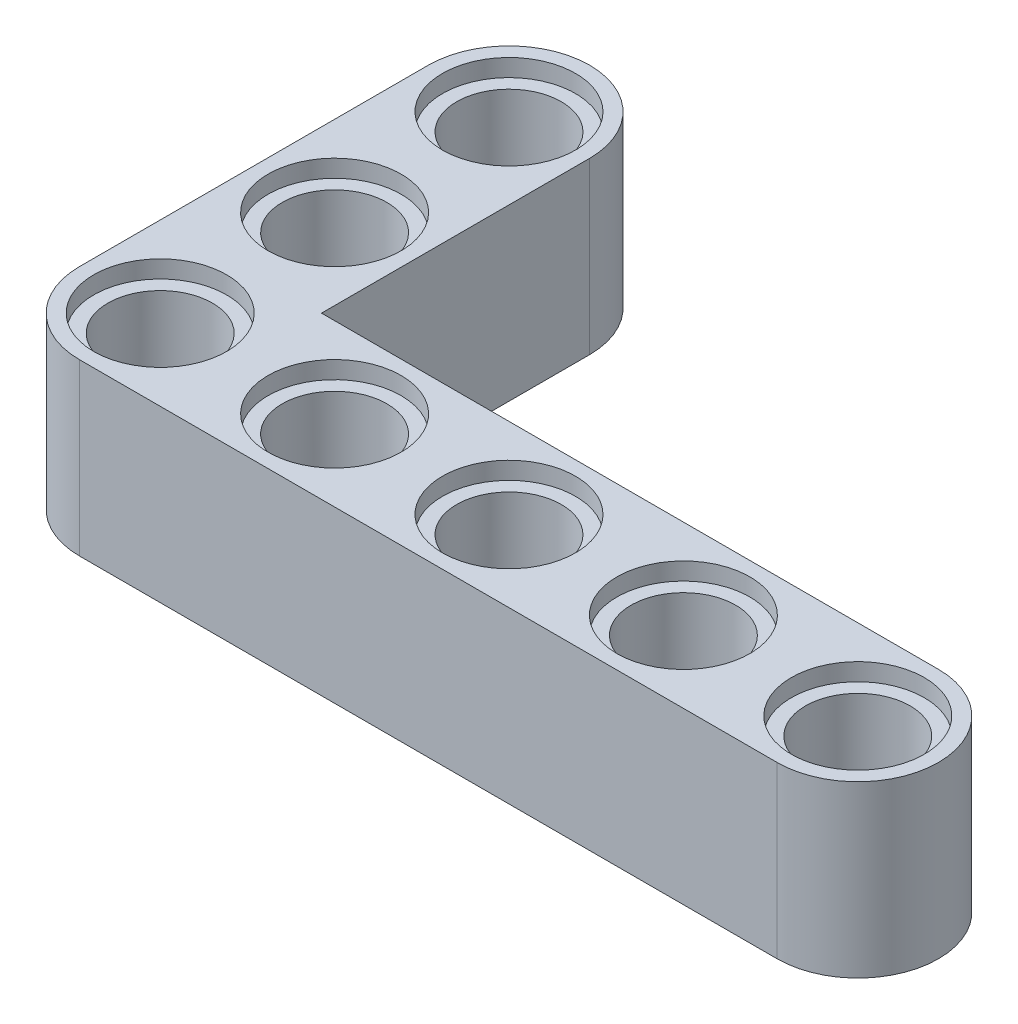
ISO-10303-21;
HEADER;
FILE_DESCRIPTION(('STEP AP214'),'2;1');
FILE_NAME('part.step','',(''),(''),'','','');
FILE_SCHEMA(('AUTOMOTIVE_DESIGN { 1 0 10303 214 1 1 1 1 }'));
ENDSEC;
DATA;
#1=APPLICATION_CONTEXT('core data for automotive mechanical design processes');
#2=APPLICATION_PROTOCOL_DEFINITION('international standard','automotive_design',2000,#1);
#3=PRODUCT_CONTEXT('',#1,'mechanical');
#4=PRODUCT('Part','Part','',(#3));
#5=PRODUCT_RELATED_PRODUCT_CATEGORY('part','',(#4));
#6=PRODUCT_DEFINITION_FORMATION('','',#4);
#7=PRODUCT_DEFINITION_CONTEXT('part definition',#1,'design');
#8=PRODUCT_DEFINITION('design','',#6,#7);
#9=PRODUCT_DEFINITION_SHAPE('','',#8);
#10=(LENGTH_UNIT() NAMED_UNIT(*) SI_UNIT(.MILLI.,.METRE.));
#11=(NAMED_UNIT(*) PLANE_ANGLE_UNIT() SI_UNIT($,.RADIAN.));
#12=(NAMED_UNIT(*) SI_UNIT($,.STERADIAN.) SOLID_ANGLE_UNIT());
#13=UNCERTAINTY_MEASURE_WITH_UNIT(LENGTH_MEASURE(1.E-05),#10,'distance_accuracy_value','');
#14=(GEOMETRIC_REPRESENTATION_CONTEXT(3) GLOBAL_UNCERTAINTY_ASSIGNED_CONTEXT((#13)) GLOBAL_UNIT_ASSIGNED_CONTEXT((#10,
#11,#12)) REPRESENTATION_CONTEXT('',''));
#15=CARTESIAN_POINT('',(0.,0.,0.));
#16=DIRECTION('',(0.,0.,1.));
#17=DIRECTION('',(1.,0.,0.));
#18=AXIS2_PLACEMENT_3D('',#15,#16,#17);
#19=CARTESIAN_POINT('',(0.,0.,0.));
#20=DIRECTION('',(0.,1.,0.));
#21=DIRECTION('',(0.,0.,1.));
#22=AXIS2_PLACEMENT_3D('',#19,#20,#21);
#23=CYLINDRICAL_SURFACE('',#22,2.4);
#24=CARTESIAN_POINT('',(0.,7.,0.));
#25=DIRECTION('',(0.,1.,0.));
#26=DIRECTION('',(0.,0.,1.));
#27=AXIS2_PLACEMENT_3D('',#24,#25,#26);
#28=CIRCLE('',#27,2.4);
#29=CARTESIAN_POINT('',(0.,7.,2.4));
#30=VERTEX_POINT('',#29);
#31=EDGE_CURVE('E134',#30,#30,#28,.F.);
#32=ORIENTED_EDGE('',*,*,#31,.F.);
#33=EDGE_LOOP('',(#32));
#34=FACE_BOUND('',#33,.T.);
#35=CARTESIAN_POINT('',(0.,0.8,0.));
#36=DIRECTION('',(0.,-1.,0.));
#37=DIRECTION('',(0.,0.,-1.));
#38=AXIS2_PLACEMENT_3D('',#35,#36,#37);
#39=CIRCLE('',#38,2.4);
#40=CARTESIAN_POINT('',(0.,0.8,-2.4));
#41=VERTEX_POINT('',#40);
#42=EDGE_CURVE('E40',#41,#41,#39,.F.);
#43=ORIENTED_EDGE('',*,*,#42,.F.);
#44=EDGE_LOOP('',(#43));
#45=FACE_BOUND('',#44,.T.);
#46=ADVANCED_FACE('F36',(#34,#45),#23,.F.);
#47=CARTESIAN_POINT('',(-16.,0.,-8.));
#48=DIRECTION('',(0.,1.,0.));
#49=DIRECTION('',(0.,0.,1.));
#50=AXIS2_PLACEMENT_3D('',#47,#48,#49);
#51=CYLINDRICAL_SURFACE('',#50,2.4);
#52=CARTESIAN_POINT('',(-16.,7.,-8.));
#53=DIRECTION('',(0.,1.,0.));
#54=DIRECTION('',(0.,0.,1.));
#55=AXIS2_PLACEMENT_3D('',#52,#53,#54);
#56=CIRCLE('',#55,2.4);
#57=CARTESIAN_POINT('',(-16.,7.,-5.6));
#58=VERTEX_POINT('',#57);
#59=EDGE_CURVE('E166',#58,#58,#56,.F.);
#60=ORIENTED_EDGE('',*,*,#59,.F.);
#61=EDGE_LOOP('',(#60));
#62=FACE_BOUND('',#61,.T.);
#63=CARTESIAN_POINT('',(-16.,0.8,-8.));
#64=DIRECTION('',(0.,-1.,0.));
#65=DIRECTION('',(0.,0.,-1.));
#66=AXIS2_PLACEMENT_3D('',#63,#64,#65);
#67=CIRCLE('',#66,2.4);
#68=CARTESIAN_POINT('',(-16.,0.8,-10.4));
#69=VERTEX_POINT('',#68);
#70=EDGE_CURVE('E189',#69,#69,#67,.F.);
#71=ORIENTED_EDGE('',*,*,#70,.F.);
#72=EDGE_LOOP('',(#71));
#73=FACE_BOUND('',#72,.T.);
#74=ADVANCED_FACE('F240',(#62,#73),#51,.F.);
#75=CARTESIAN_POINT('',(-16.,0.,-16.));
#76=DIRECTION('',(0.,1.,0.));
#77=DIRECTION('',(0.,0.,1.));
#78=AXIS2_PLACEMENT_3D('',#75,#76,#77);
#79=CYLINDRICAL_SURFACE('',#78,2.4);
#80=CARTESIAN_POINT('',(-16.,7.,-16.));
#81=DIRECTION('',(0.,1.,0.));
#82=DIRECTION('',(0.,0.,1.));
#83=AXIS2_PLACEMENT_3D('',#80,#81,#82);
#84=CIRCLE('',#83,2.4);
#85=CARTESIAN_POINT('',(-16.,7.,-13.6));
#86=VERTEX_POINT('',#85);
#87=EDGE_CURVE('E163',#86,#86,#84,.F.);
#88=ORIENTED_EDGE('',*,*,#87,.F.);
#89=EDGE_LOOP('',(#88));
#90=FACE_BOUND('',#89,.T.);
#91=CARTESIAN_POINT('',(-16.,0.8,-16.));
#92=DIRECTION('',(0.,-1.,0.));
#93=DIRECTION('',(0.,0.,-1.));
#94=AXIS2_PLACEMENT_3D('',#91,#92,#93);
#95=CIRCLE('',#94,2.4);
#96=CARTESIAN_POINT('',(-16.,0.8,-18.4));
#97=VERTEX_POINT('',#96);
#98=EDGE_CURVE('E187',#97,#97,#95,.F.);
#99=ORIENTED_EDGE('',*,*,#98,.F.);
#100=EDGE_LOOP('',(#99));
#101=FACE_BOUND('',#100,.T.);
#102=ADVANCED_FACE('F246',(#90,#101),#79,.F.);
#103=CARTESIAN_POINT('',(8.,0.,0.));
#104=DIRECTION('',(0.,1.,0.));
#105=DIRECTION('',(0.,0.,1.));
#106=AXIS2_PLACEMENT_3D('',#103,#104,#105);
#107=CYLINDRICAL_SURFACE('',#106,2.4);
#108=CARTESIAN_POINT('',(8.,7.,0.));
#109=DIRECTION('',(0.,1.,0.));
#110=DIRECTION('',(0.,0.,1.));
#111=AXIS2_PLACEMENT_3D('',#108,#109,#110);
#112=CIRCLE('',#111,2.4);
#113=CARTESIAN_POINT('',(8.,7.,2.4));
#114=VERTEX_POINT('',#113);
#115=EDGE_CURVE('E160',#114,#114,#112,.F.);
#116=ORIENTED_EDGE('',*,*,#115,.F.);
#117=EDGE_LOOP('',(#116));
#118=FACE_BOUND('',#117,.T.);
#119=CARTESIAN_POINT('',(8.,0.8,0.));
#120=DIRECTION('',(0.,-1.,0.));
#121=DIRECTION('',(0.,0.,-1.));
#122=AXIS2_PLACEMENT_3D('',#119,#120,#121);
#123=CIRCLE('',#122,2.4);
#124=CARTESIAN_POINT('',(8.,0.8,-2.4));
#125=VERTEX_POINT('',#124);
#126=EDGE_CURVE('E184',#125,#125,#123,.F.);
#127=ORIENTED_EDGE('',*,*,#126,.F.);
#128=EDGE_LOOP('',(#127));
#129=FACE_BOUND('',#128,.T.);
#130=ADVANCED_FACE('F252',(#118,#129),#107,.F.);
#131=CARTESIAN_POINT('',(-16.,0.,0.));
#132=DIRECTION('',(0.,1.,0.));
#133=DIRECTION('',(0.,0.,1.));
#134=AXIS2_PLACEMENT_3D('',#131,#132,#133);
#135=CYLINDRICAL_SURFACE('',#134,2.4);
#136=CARTESIAN_POINT('',(-16.,7.,0.));
#137=DIRECTION('',(0.,1.,0.));
#138=DIRECTION('',(0.,0.,1.));
#139=AXIS2_PLACEMENT_3D('',#136,#137,#138);
#140=CIRCLE('',#139,2.4);
#141=CARTESIAN_POINT('',(-16.,7.,2.4));
#142=VERTEX_POINT('',#141);
#143=EDGE_CURVE('E153',#142,#142,#140,.F.);
#144=ORIENTED_EDGE('',*,*,#143,.F.);
#145=EDGE_LOOP('',(#144));
#146=FACE_BOUND('',#145,.T.);
#147=CARTESIAN_POINT('',(-16.,0.8,0.));
#148=DIRECTION('',(0.,-1.,0.));
#149=DIRECTION('',(0.,0.,-1.));
#150=AXIS2_PLACEMENT_3D('',#147,#148,#149);
#151=CIRCLE('',#150,2.4);
#152=CARTESIAN_POINT('',(-16.,0.8,-2.4));
#153=VERTEX_POINT('',#152);
#154=EDGE_CURVE('E181',#153,#153,#151,.F.);
#155=ORIENTED_EDGE('',*,*,#154,.F.);
#156=EDGE_LOOP('',(#155));
#157=FACE_BOUND('',#156,.T.);
#158=ADVANCED_FACE('F363',(#146,#157),#135,.F.);
#159=CARTESIAN_POINT('',(-19.7,7.8,-16.));
#160=DIRECTION('',(1.,0.,0.));
#161=DIRECTION('',(0.,0.,-1.));
#162=AXIS2_PLACEMENT_3D('',#159,#160,#161);
#163=PLANE('',#162);
#164=DIRECTION('',(0.,0.,1.));
#165=VECTOR('',#164,1.);
#166=CARTESIAN_POINT('',(-19.7,0.,-16.));
#167=LINE('',#166,#165);
#168=CARTESIAN_POINT('',(-19.7,0.,-16.));
#169=VERTEX_POINT('',#168);
#170=CARTESIAN_POINT('',(-19.7,0.,0.));
#171=VERTEX_POINT('',#170);
#172=EDGE_CURVE('E130',#169,#171,#167,.T.);
#173=ORIENTED_EDGE('',*,*,#172,.T.);
#174=DIRECTION('',(0.,-1.,0.));
#175=VECTOR('',#174,1.);
#176=CARTESIAN_POINT('',(-19.7,7.8,0.));
#177=LINE('',#176,#175);
#178=CARTESIAN_POINT('',(-19.7,7.8,0.));
#179=VERTEX_POINT('',#178);
#180=EDGE_CURVE('E11',#179,#171,#177,.T.);
#181=ORIENTED_EDGE('',*,*,#180,.F.);
#182=DIRECTION('',(0.,0.,1.));
#183=VECTOR('',#182,1.);
#184=CARTESIAN_POINT('',(-19.7,7.8,-16.));
#185=LINE('',#184,#183);
#186=CARTESIAN_POINT('',(-19.7,7.8,-16.));
#187=VERTEX_POINT('',#186);
#188=EDGE_CURVE('E145',#187,#179,#185,.T.);
#189=ORIENTED_EDGE('',*,*,#188,.F.);
#190=DIRECTION('',(0.,-1.,0.));
#191=VECTOR('',#190,1.);
#192=CARTESIAN_POINT('',(-19.7,7.8,-16.));
#193=LINE('',#192,#191);
#194=EDGE_CURVE('E129',#187,#169,#193,.T.);
#195=ORIENTED_EDGE('',*,*,#194,.T.);
#196=EDGE_LOOP('',(#173,#181,#189,#195));
#197=FACE_BOUND('',#196,.T.);
#198=ADVANCED_FACE('F38',(#197),#163,.F.);
#199=CARTESIAN_POINT('',(-16.,7.8,0.));
#200=DIRECTION('',(0.,-1.,0.));
#201=DIRECTION('',(0.,0.,-1.));
#202=AXIS2_PLACEMENT_3D('',#199,#200,#201);
#203=CYLINDRICAL_SURFACE('',#202,3.7);
#204=CARTESIAN_POINT('',(-16.,0.,0.));
#205=DIRECTION('',(0.,1.,0.));
#206=DIRECTION('',(0.,0.,1.));
#207=AXIS2_PLACEMENT_3D('',#204,#205,#206);
#208=CIRCLE('',#207,3.7);
#209=CARTESIAN_POINT('',(-16.,0.,3.7));
#210=VERTEX_POINT('',#209);
#211=EDGE_CURVE('E133',#171,#210,#208,.T.);
#212=ORIENTED_EDGE('',*,*,#211,.T.);
#213=DIRECTION('',(0.,-1.,0.));
#214=VECTOR('',#213,1.);
#215=CARTESIAN_POINT('',(-16.,7.8,3.7));
#216=LINE('',#215,#214);
#217=CARTESIAN_POINT('',(-16.,7.8,3.7));
#218=VERTEX_POINT('',#217);
#219=EDGE_CURVE('E46',#218,#210,#216,.T.);
#220=ORIENTED_EDGE('',*,*,#219,.F.);
#221=CARTESIAN_POINT('',(-16.,7.8,0.));
#222=DIRECTION('',(0.,1.,0.));
#223=DIRECTION('',(0.,0.,1.));
#224=AXIS2_PLACEMENT_3D('',#221,#222,#223);
#225=CIRCLE('',#224,3.7);
#226=EDGE_CURVE('E94',#179,#218,#225,.T.);
#227=ORIENTED_EDGE('',*,*,#226,.F.);
#228=ORIENTED_EDGE('',*,*,#180,.T.);
#229=EDGE_LOOP('',(#212,#220,#227,#228));
#230=FACE_BOUND('',#229,.T.);
#231=ADVANCED_FACE('F706',(#230),#203,.T.);
#232=CARTESIAN_POINT('',(-16.,7.8,3.7));
#233=DIRECTION('',(0.,0.,-1.));
#234=DIRECTION('',(-1.,0.,0.));
#235=AXIS2_PLACEMENT_3D('',#232,#233,#234);
#236=PLANE('',#235);
#237=DIRECTION('',(1.,0.,0.));
#238=VECTOR('',#237,1.);
#239=CARTESIAN_POINT('',(-16.,0.,3.7));
#240=LINE('',#239,#238);
#241=CARTESIAN_POINT('',(16.,0.,3.7));
#242=VERTEX_POINT('',#241);
#243=EDGE_CURVE('E136',#210,#242,#240,.T.);
#244=ORIENTED_EDGE('',*,*,#243,.T.);
#245=DIRECTION('',(0.,-1.,0.));
#246=VECTOR('',#245,1.);
#247=CARTESIAN_POINT('',(16.,7.8,3.7));
#248=LINE('',#247,#246);
#249=CARTESIAN_POINT('',(16.,7.8,3.7));
#250=VERTEX_POINT('',#249);
#251=EDGE_CURVE('E149',#250,#242,#248,.T.);
#252=ORIENTED_EDGE('',*,*,#251,.F.);
#253=DIRECTION('',(1.,0.,0.));
#254=VECTOR('',#253,1.);
#255=CARTESIAN_POINT('',(-16.,7.8,3.7));
#256=LINE('',#255,#254);
#257=EDGE_CURVE('E124',#218,#250,#256,.T.);
#258=ORIENTED_EDGE('',*,*,#257,.F.);
#259=ORIENTED_EDGE('',*,*,#219,.T.);
#260=EDGE_LOOP('',(#244,#252,#258,#259));
#261=FACE_BOUND('',#260,.T.);
#262=ADVANCED_FACE('F217',(#261),#236,.F.);
#263=CARTESIAN_POINT('',(16.,7.8,0.));
#264=DIRECTION('',(0.,-1.,0.));
#265=DIRECTION('',(0.,0.,-1.));
#266=AXIS2_PLACEMENT_3D('',#263,#264,#265);
#267=CYLINDRICAL_SURFACE('',#266,3.7);
#268=CARTESIAN_POINT('',(16.,0.,0.));
#269=DIRECTION('',(0.,-1.,0.));
#270=DIRECTION('',(0.,0.,-1.));
#271=AXIS2_PLACEMENT_3D('',#268,#269,#270);
#272=CIRCLE('',#271,3.7);
#273=CARTESIAN_POINT('',(16.,0.,-3.7));
#274=VERTEX_POINT('',#273);
#275=EDGE_CURVE('E139',#274,#242,#272,.T.);
#276=ORIENTED_EDGE('',*,*,#275,.F.);
#277=DIRECTION('',(0.,-1.,0.));
#278=VECTOR('',#277,1.);
#279=CARTESIAN_POINT('',(16.,7.8,-3.7));
#280=LINE('',#279,#278);
#281=CARTESIAN_POINT('',(16.,7.8,-3.7));
#282=VERTEX_POINT('',#281);
#283=EDGE_CURVE('E113',#282,#274,#280,.T.);
#284=ORIENTED_EDGE('',*,*,#283,.F.);
#285=CARTESIAN_POINT('',(16.,7.8,0.));
#286=DIRECTION('',(0.,-1.,0.));
#287=DIRECTION('',(0.,0.,-1.));
#288=AXIS2_PLACEMENT_3D('',#285,#286,#287);
#289=CIRCLE('',#288,3.7);
#290=EDGE_CURVE('E122',#282,#250,#289,.T.);
#291=ORIENTED_EDGE('',*,*,#290,.T.);
#292=ORIENTED_EDGE('',*,*,#251,.T.);
#293=EDGE_LOOP('',(#276,#284,#291,#292));
#294=FACE_BOUND('',#293,.T.);
#295=ADVANCED_FACE('F221',(#294),#267,.T.);
#296=CARTESIAN_POINT('',(-12.3,7.8,-3.7));
#297=DIRECTION('',(0.,0.,-1.));
#298=DIRECTION('',(-1.,0.,0.));
#299=AXIS2_PLACEMENT_3D('',#296,#297,#298);
#300=PLANE('',#299);
#301=DIRECTION('',(1.,0.,0.));
#302=VECTOR('',#301,1.);
#303=CARTESIAN_POINT('',(-12.3,0.,-3.7));
#304=LINE('',#303,#302);
#305=CARTESIAN_POINT('',(-12.3,0.,-3.7));
#306=VERTEX_POINT('',#305);
#307=EDGE_CURVE('E112',#306,#274,#304,.T.);
#308=ORIENTED_EDGE('',*,*,#307,.F.);
#309=DIRECTION('',(0.,-1.,0.));
#310=VECTOR('',#309,1.);
#311=CARTESIAN_POINT('',(-12.3,7.8,-3.7));
#312=LINE('',#311,#310);
#313=CARTESIAN_POINT('',(-12.3,7.8,-3.7));
#314=VERTEX_POINT('',#313);
#315=EDGE_CURVE('E106',#314,#306,#312,.T.);
#316=ORIENTED_EDGE('',*,*,#315,.F.);
#317=DIRECTION('',(1.,0.,0.));
#318=VECTOR('',#317,1.);
#319=CARTESIAN_POINT('',(-12.3,7.8,-3.7));
#320=LINE('',#319,#318);
#321=EDGE_CURVE('E110',#314,#282,#320,.T.);
#322=ORIENTED_EDGE('',*,*,#321,.T.);
#323=ORIENTED_EDGE('',*,*,#283,.T.);
#324=EDGE_LOOP('',(#308,#316,#322,#323));
#325=FACE_BOUND('',#324,.T.);
#326=ADVANCED_FACE('F108',(#325),#300,.T.);
#327=CARTESIAN_POINT('',(-12.3,7.8,-3.7));
#328=DIRECTION('',(-1.,0.,0.));
#329=DIRECTION('',(0.,0.,1.));
#330=AXIS2_PLACEMENT_3D('',#327,#328,#329);
#331=PLANE('',#330);
#332=DIRECTION('',(0.,0.,-1.));
#333=VECTOR('',#332,1.);
#334=CARTESIAN_POINT('',(-12.3,0.,-3.7));
#335=LINE('',#334,#333);
#336=CARTESIAN_POINT('',(-12.3,0.,-16.));
#337=VERTEX_POINT('',#336);
#338=EDGE_CURVE('E80',#306,#337,#335,.T.);
#339=ORIENTED_EDGE('',*,*,#338,.T.);
#340=DIRECTION('',(0.,-1.,0.));
#341=VECTOR('',#340,1.);
#342=CARTESIAN_POINT('',(-12.3,7.8,-16.));
#343=LINE('',#342,#341);
#344=CARTESIAN_POINT('',(-12.3,7.8,-16.));
#345=VERTEX_POINT('',#344);
#346=EDGE_CURVE('E114',#345,#337,#343,.T.);
#347=ORIENTED_EDGE('',*,*,#346,.F.);
#348=DIRECTION('',(0.,0.,-1.));
#349=VECTOR('',#348,1.);
#350=CARTESIAN_POINT('',(-12.3,7.8,-3.7));
#351=LINE('',#350,#349);
#352=EDGE_CURVE('E116',#314,#345,#351,.T.);
#353=ORIENTED_EDGE('',*,*,#352,.F.);
#354=ORIENTED_EDGE('',*,*,#315,.T.);
#355=EDGE_LOOP('',(#339,#347,#353,#354));
#356=FACE_BOUND('',#355,.T.);
#357=ADVANCED_FACE('F117',(#356),#331,.F.);
#358=CARTESIAN_POINT('',(-16.,7.8,-16.));
#359=DIRECTION('',(0.,-1.,0.));
#360=DIRECTION('',(0.,0.,-1.));
#361=AXIS2_PLACEMENT_3D('',#358,#359,#360);
#362=CYLINDRICAL_SURFACE('',#361,3.7);
#363=CARTESIAN_POINT('',(-16.,0.,-16.));
#364=DIRECTION('',(0.,1.,0.));
#365=DIRECTION('',(0.,0.,1.));
#366=AXIS2_PLACEMENT_3D('',#363,#364,#365);
#367=CIRCLE('',#366,3.7);
#368=EDGE_CURVE('E86',#337,#169,#367,.T.);
#369=ORIENTED_EDGE('',*,*,#368,.T.);
#370=ORIENTED_EDGE('',*,*,#194,.F.);
#371=CARTESIAN_POINT('',(-16.,7.8,-16.));
#372=DIRECTION('',(0.,1.,0.));
#373=DIRECTION('',(0.,0.,1.));
#374=AXIS2_PLACEMENT_3D('',#371,#372,#373);
#375=CIRCLE('',#374,3.7);
#376=EDGE_CURVE('E55',#345,#187,#375,.T.);
#377=ORIENTED_EDGE('',*,*,#376,.F.);
#378=ORIENTED_EDGE('',*,*,#346,.T.);
#379=EDGE_LOOP('',(#369,#370,#377,#378));
#380=FACE_BOUND('',#379,.T.);
#381=ADVANCED_FACE('F228',(#380),#362,.T.);
#382=CARTESIAN_POINT('',(-16.,7.8,0.));
#383=DIRECTION('',(0.,1.,0.));
#384=DIRECTION('',(0.,0.,1.));
#385=AXIS2_PLACEMENT_3D('',#382,#383,#384);
#386=PLANE('',#385);
#387=CARTESIAN_POINT('',(-16.,7.8,-16.));
#388=DIRECTION('',(0.,1.,0.));
#389=DIRECTION('',(0.,0.,1.));
#390=AXIS2_PLACEMENT_3D('',#387,#388,#389);
#391=CIRCLE('',#390,3.05);
#392=CARTESIAN_POINT('',(-16.,7.8,-12.95));
#393=VERTEX_POINT('',#392);
#394=EDGE_CURVE('E194',#393,#393,#391,.T.);
#395=ORIENTED_EDGE('',*,*,#394,.F.);
#396=EDGE_LOOP('',(#395));
#397=FACE_BOUND('',#396,.T.);
#398=CARTESIAN_POINT('',(-16.,7.8,-8.));
#399=DIRECTION('',(0.,1.,0.));
#400=DIRECTION('',(0.,0.,1.));
#401=AXIS2_PLACEMENT_3D('',#398,#399,#400);
#402=CIRCLE('',#401,3.05);
#403=CARTESIAN_POINT('',(-16.,7.8,-4.95));
#404=VERTEX_POINT('',#403);
#405=EDGE_CURVE('E203',#404,#404,#402,.T.);
#406=ORIENTED_EDGE('',*,*,#405,.F.);
#407=EDGE_LOOP('',(#406));
#408=FACE_BOUND('',#407,.T.);
#409=CARTESIAN_POINT('',(-8.,7.8,0.));
#410=DIRECTION('',(0.,1.,0.));
#411=DIRECTION('',(0.,0.,-1.));
#412=AXIS2_PLACEMENT_3D('',#409,#410,#411);
#413=CIRCLE('',#412,3.05);
#414=CARTESIAN_POINT('',(-8.,7.8,-3.05));
#415=VERTEX_POINT('',#414);
#416=EDGE_CURVE('E319',#415,#415,#413,.T.);
#417=ORIENTED_EDGE('',*,*,#416,.F.);
#418=EDGE_LOOP('',(#417));
#419=FACE_BOUND('',#418,.T.);
#420=CARTESIAN_POINT('',(-16.,7.8,0.));
#421=DIRECTION('',(0.,1.,0.));
#422=DIRECTION('',(0.,0.,1.));
#423=AXIS2_PLACEMENT_3D('',#420,#421,#422);
#424=CIRCLE('',#423,3.05);
#425=CARTESIAN_POINT('',(-16.,7.8,3.05));
#426=VERTEX_POINT('',#425);
#427=EDGE_CURVE('E313',#426,#426,#424,.T.);
#428=ORIENTED_EDGE('',*,*,#427,.F.);
#429=EDGE_LOOP('',(#428));
#430=FACE_BOUND('',#429,.T.);
#431=CARTESIAN_POINT('',(16.,7.8,0.));
#432=DIRECTION('',(0.,1.,0.));
#433=DIRECTION('',(0.,0.,-1.));
#434=AXIS2_PLACEMENT_3D('',#431,#432,#433);
#435=CIRCLE('',#434,3.05);
#436=CARTESIAN_POINT('',(16.,7.8,-3.05));
#437=VERTEX_POINT('',#436);
#438=EDGE_CURVE('E307',#437,#437,#435,.T.);
#439=ORIENTED_EDGE('',*,*,#438,.F.);
#440=EDGE_LOOP('',(#439));
#441=FACE_BOUND('',#440,.T.);
#442=CARTESIAN_POINT('',(0.,7.8,0.));
#443=DIRECTION('',(0.,1.,0.));
#444=DIRECTION('',(0.,0.,1.));
#445=AXIS2_PLACEMENT_3D('',#442,#443,#444);
#446=CIRCLE('',#445,3.05);
#447=CARTESIAN_POINT('',(0.,7.8,3.05));
#448=VERTEX_POINT('',#447);
#449=EDGE_CURVE('E301',#448,#448,#446,.T.);
#450=ORIENTED_EDGE('',*,*,#449,.F.);
#451=EDGE_LOOP('',(#450));
#452=FACE_BOUND('',#451,.T.);
#453=CARTESIAN_POINT('',(8.,7.8,0.));
#454=DIRECTION('',(0.,1.,0.));
#455=DIRECTION('',(0.,0.,1.));
#456=AXIS2_PLACEMENT_3D('',#453,#454,#455);
#457=CIRCLE('',#456,3.05);
#458=CARTESIAN_POINT('',(8.,7.8,3.05));
#459=VERTEX_POINT('',#458);
#460=EDGE_CURVE('E209',#459,#459,#457,.T.);
#461=ORIENTED_EDGE('',*,*,#460,.F.);
#462=EDGE_LOOP('',(#461));
#463=FACE_BOUND('',#462,.T.);
#464=ORIENTED_EDGE('',*,*,#188,.T.);
#465=ORIENTED_EDGE('',*,*,#226,.T.);
#466=ORIENTED_EDGE('',*,*,#257,.T.);
#467=ORIENTED_EDGE('',*,*,#290,.F.);
#468=ORIENTED_EDGE('',*,*,#321,.F.);
#469=ORIENTED_EDGE('',*,*,#352,.T.);
#470=ORIENTED_EDGE('',*,*,#376,.T.);
#471=EDGE_LOOP('',(#464,#465,#466,#467,#468,#469,#470));
#472=FACE_BOUND('',#471,.T.);
#473=ADVANCED_FACE('F120',(#397,#408,#419,#430,#441,#452,#463,#472),#386,.T.);
#474=CARTESIAN_POINT('',(-16.,0.,0.));
#475=DIRECTION('',(0.,1.,0.));
#476=DIRECTION('',(0.,0.,1.));
#477=AXIS2_PLACEMENT_3D('',#474,#475,#476);
#478=PLANE('',#477);
#479=CARTESIAN_POINT('',(-16.,0.,-16.));
#480=DIRECTION('',(0.,-1.,0.));
#481=DIRECTION('',(0.,0.,-1.));
#482=AXIS2_PLACEMENT_3D('',#479,#480,#481);
#483=CIRCLE('',#482,3.05);
#484=CARTESIAN_POINT('',(-16.,0.,-19.05));
#485=VERTEX_POINT('',#484);
#486=EDGE_CURVE('E266',#485,#485,#483,.T.);
#487=ORIENTED_EDGE('',*,*,#486,.F.);
#488=EDGE_LOOP('',(#487));
#489=FACE_BOUND('',#488,.T.);
#490=CARTESIAN_POINT('',(-16.,0.,-8.));
#491=DIRECTION('',(0.,-1.,0.));
#492=DIRECTION('',(0.,0.,-1.));
#493=AXIS2_PLACEMENT_3D('',#490,#491,#492);
#494=CIRCLE('',#493,3.05);
#495=CARTESIAN_POINT('',(-16.,0.,-11.05));
#496=VERTEX_POINT('',#495);
#497=EDGE_CURVE('E270',#496,#496,#494,.T.);
#498=ORIENTED_EDGE('',*,*,#497,.F.);
#499=EDGE_LOOP('',(#498));
#500=FACE_BOUND('',#499,.T.);
#501=CARTESIAN_POINT('',(-8.,0.,0.));
#502=DIRECTION('',(0.,-1.,0.));
#503=DIRECTION('',(0.,0.,1.));
#504=AXIS2_PLACEMENT_3D('',#501,#502,#503);
#505=CIRCLE('',#504,3.05);
#506=CARTESIAN_POINT('',(-8.,0.,3.05));
#507=VERTEX_POINT('',#506);
#508=EDGE_CURVE('E274',#507,#507,#505,.T.);
#509=ORIENTED_EDGE('',*,*,#508,.F.);
#510=EDGE_LOOP('',(#509));
#511=FACE_BOUND('',#510,.T.);
#512=CARTESIAN_POINT('',(-16.,0.,0.));
#513=DIRECTION('',(0.,-1.,0.));
#514=DIRECTION('',(0.,0.,-1.));
#515=AXIS2_PLACEMENT_3D('',#512,#513,#514);
#516=CIRCLE('',#515,3.05);
#517=CARTESIAN_POINT('',(-16.,0.,-3.05));
#518=VERTEX_POINT('',#517);
#519=EDGE_CURVE('E278',#518,#518,#516,.T.);
#520=ORIENTED_EDGE('',*,*,#519,.F.);
#521=EDGE_LOOP('',(#520));
#522=FACE_BOUND('',#521,.T.);
#523=CARTESIAN_POINT('',(16.,0.,0.));
#524=DIRECTION('',(0.,-1.,0.));
#525=DIRECTION('',(0.,0.,1.));
#526=AXIS2_PLACEMENT_3D('',#523,#524,#525);
#527=CIRCLE('',#526,3.05);
#528=CARTESIAN_POINT('',(16.,0.,3.05));
#529=VERTEX_POINT('',#528);
#530=EDGE_CURVE('E282',#529,#529,#527,.T.);
#531=ORIENTED_EDGE('',*,*,#530,.F.);
#532=EDGE_LOOP('',(#531));
#533=FACE_BOUND('',#532,.T.);
#534=CARTESIAN_POINT('',(0.,0.,0.));
#535=DIRECTION('',(0.,-1.,0.));
#536=DIRECTION('',(0.,0.,-1.));
#537=AXIS2_PLACEMENT_3D('',#534,#535,#536);
#538=CIRCLE('',#537,3.05);
#539=CARTESIAN_POINT('',(0.,0.,-3.05));
#540=VERTEX_POINT('',#539);
#541=EDGE_CURVE('E286',#540,#540,#538,.T.);
#542=ORIENTED_EDGE('',*,*,#541,.F.);
#543=EDGE_LOOP('',(#542));
#544=FACE_BOUND('',#543,.T.);
#545=CARTESIAN_POINT('',(8.,0.,0.));
#546=DIRECTION('',(0.,-1.,0.));
#547=DIRECTION('',(0.,0.,-1.));
#548=AXIS2_PLACEMENT_3D('',#545,#546,#547);
#549=CIRCLE('',#548,3.05);
#550=CARTESIAN_POINT('',(8.,0.,-3.05));
#551=VERTEX_POINT('',#550);
#552=EDGE_CURVE('E289',#551,#551,#549,.T.);
#553=ORIENTED_EDGE('',*,*,#552,.F.);
#554=EDGE_LOOP('',(#553));
#555=FACE_BOUND('',#554,.T.);
#556=ORIENTED_EDGE('',*,*,#172,.F.);
#557=ORIENTED_EDGE('',*,*,#368,.F.);
#558=ORIENTED_EDGE('',*,*,#338,.F.);
#559=ORIENTED_EDGE('',*,*,#307,.T.);
#560=ORIENTED_EDGE('',*,*,#275,.T.);
#561=ORIENTED_EDGE('',*,*,#243,.F.);
#562=ORIENTED_EDGE('',*,*,#211,.F.);
#563=EDGE_LOOP('',(#556,#557,#558,#559,#560,#561,#562));
#564=FACE_BOUND('',#563,.T.);
#565=ADVANCED_FACE('F224',(#489,#500,#511,#522,#533,#544,#555,#564),#478,.F.);
#566=CARTESIAN_POINT('',(-8.,0.,0.));
#567=DIRECTION('',(0.,1.,0.));
#568=DIRECTION('',(0.,0.,1.));
#569=AXIS2_PLACEMENT_3D('',#566,#567,#568);
#570=CYLINDRICAL_SURFACE('',#569,2.4);
#571=CARTESIAN_POINT('',(-8.,0.8,0.));
#572=DIRECTION('',(0.,1.,0.));
#573=DIRECTION('',(0.,0.,1.));
#574=AXIS2_PLACEMENT_3D('',#571,#572,#573);
#575=CIRCLE('',#574,2.4);
#576=CARTESIAN_POINT('',(-8.,0.8,2.4));
#577=VERTEX_POINT('',#576);
#578=EDGE_CURVE('E177',#577,#577,#575,.F.);
#579=ORIENTED_EDGE('',*,*,#578,.T.);
#580=EDGE_LOOP('',(#579));
#581=FACE_BOUND('',#580,.T.);
#582=CARTESIAN_POINT('',(-8.,7.,0.));
#583=DIRECTION('',(0.,-1.,0.));
#584=DIRECTION('',(0.,0.,-1.));
#585=AXIS2_PLACEMENT_3D('',#582,#583,#584);
#586=CIRCLE('',#585,2.4);
#587=CARTESIAN_POINT('',(-8.,7.,-2.4));
#588=VERTEX_POINT('',#587);
#589=EDGE_CURVE('E169',#588,#588,#586,.F.);
#590=ORIENTED_EDGE('',*,*,#589,.T.);
#591=EDGE_LOOP('',(#590));
#592=FACE_BOUND('',#591,.T.);
#593=ADVANCED_FACE('F255',(#581,#592),#570,.F.);
#594=CARTESIAN_POINT('',(16.,0.,0.));
#595=DIRECTION('',(0.,1.,0.));
#596=DIRECTION('',(0.,0.,1.));
#597=AXIS2_PLACEMENT_3D('',#594,#595,#596);
#598=CYLINDRICAL_SURFACE('',#597,2.4);
#599=CARTESIAN_POINT('',(16.,0.8,0.));
#600=DIRECTION('',(0.,1.,0.));
#601=DIRECTION('',(0.,0.,1.));
#602=AXIS2_PLACEMENT_3D('',#599,#600,#601);
#603=CIRCLE('',#602,2.4);
#604=CARTESIAN_POINT('',(16.,0.8,2.4));
#605=VERTEX_POINT('',#604);
#606=EDGE_CURVE('E174',#605,#605,#603,.F.);
#607=ORIENTED_EDGE('',*,*,#606,.T.);
#608=EDGE_LOOP('',(#607));
#609=FACE_BOUND('',#608,.T.);
#610=CARTESIAN_POINT('',(16.,7.,0.));
#611=DIRECTION('',(0.,-1.,0.));
#612=DIRECTION('',(0.,0.,-1.));
#613=AXIS2_PLACEMENT_3D('',#610,#611,#612);
#614=CIRCLE('',#613,2.4);
#615=CARTESIAN_POINT('',(16.,7.,-2.4));
#616=VERTEX_POINT('',#615);
#617=EDGE_CURVE('E156',#616,#616,#614,.F.);
#618=ORIENTED_EDGE('',*,*,#617,.T.);
#619=EDGE_LOOP('',(#618));
#620=FACE_BOUND('',#619,.T.);
#621=ADVANCED_FACE('F260',(#609,#620),#598,.F.);
#622=CARTESIAN_POINT('',(-16.,7.,0.));
#623=DIRECTION('',(0.,1.,0.));
#624=DIRECTION('',(0.,0.,1.));
#625=AXIS2_PLACEMENT_3D('',#622,#623,#624);
#626=PLANE('',#625);
#627=CARTESIAN_POINT('',(-16.,7.,0.));
#628=DIRECTION('',(0.,1.,0.));
#629=DIRECTION('',(0.,0.,1.));
#630=AXIS2_PLACEMENT_3D('',#627,#628,#629);
#631=CIRCLE('',#630,3.05);
#632=CARTESIAN_POINT('',(-16.,7.,3.05));
#633=VERTEX_POINT('',#632);
#634=EDGE_CURVE('E310',#633,#633,#631,.T.);
#635=ORIENTED_EDGE('',*,*,#634,.T.);
#636=EDGE_LOOP('',(#635));
#637=FACE_BOUND('',#636,.T.);
#638=ORIENTED_EDGE('',*,*,#143,.T.);
#639=EDGE_LOOP('',(#638));
#640=FACE_BOUND('',#639,.T.);
#641=ADVANCED_FACE('F361',(#637,#640),#626,.T.);
#642=CARTESIAN_POINT('',(-16.,7.,0.));
#643=DIRECTION('',(0.,1.,0.));
#644=DIRECTION('',(0.,0.,1.));
#645=AXIS2_PLACEMENT_3D('',#642,#643,#644);
#646=CYLINDRICAL_SURFACE('',#645,3.05);
#647=ORIENTED_EDGE('',*,*,#634,.F.);
#648=EDGE_LOOP('',(#647));
#649=FACE_BOUND('',#648,.T.);
#650=ORIENTED_EDGE('',*,*,#427,.T.);
#651=EDGE_LOOP('',(#650));
#652=FACE_BOUND('',#651,.T.);
#653=ADVANCED_FACE('F417',(#649,#652),#646,.F.);
#654=CARTESIAN_POINT('',(16.,7.,0.));
#655=DIRECTION('',(0.,-1.,0.));
#656=DIRECTION('',(0.,0.,-1.));
#657=AXIS2_PLACEMENT_3D('',#654,#655,#656);
#658=PLANE('',#657);
#659=CARTESIAN_POINT('',(16.,7.,0.));
#660=DIRECTION('',(0.,1.,0.));
#661=DIRECTION('',(0.,0.,-1.));
#662=AXIS2_PLACEMENT_3D('',#659,#660,#661);
#663=CIRCLE('',#662,3.05);
#664=CARTESIAN_POINT('',(16.,7.,-3.05));
#665=VERTEX_POINT('',#664);
#666=EDGE_CURVE('E304',#665,#665,#663,.T.);
#667=ORIENTED_EDGE('',*,*,#666,.T.);
#668=EDGE_LOOP('',(#667));
#669=FACE_BOUND('',#668,.T.);
#670=ORIENTED_EDGE('',*,*,#617,.F.);
#671=EDGE_LOOP('',(#670));
#672=FACE_BOUND('',#671,.T.);
#673=ADVANCED_FACE('F414',(#669,#672),#658,.F.);
#674=CARTESIAN_POINT('',(16.,7.,0.));
#675=DIRECTION('',(0.,1.,0.));
#676=DIRECTION('',(0.,0.,1.));
#677=AXIS2_PLACEMENT_3D('',#674,#675,#676);
#678=CYLINDRICAL_SURFACE('',#677,3.05);
#679=ORIENTED_EDGE('',*,*,#666,.F.);
#680=EDGE_LOOP('',(#679));
#681=FACE_BOUND('',#680,.T.);
#682=ORIENTED_EDGE('',*,*,#438,.T.);
#683=EDGE_LOOP('',(#682));
#684=FACE_BOUND('',#683,.T.);
#685=ADVANCED_FACE('F353',(#681,#684),#678,.F.);
#686=CARTESIAN_POINT('',(8.,7.,0.));
#687=DIRECTION('',(0.,1.,0.));
#688=DIRECTION('',(0.,0.,1.));
#689=AXIS2_PLACEMENT_3D('',#686,#687,#688);
#690=PLANE('',#689);
#691=CARTESIAN_POINT('',(8.,7.,0.));
#692=DIRECTION('',(0.,1.,0.));
#693=DIRECTION('',(0.,0.,1.));
#694=AXIS2_PLACEMENT_3D('',#691,#692,#693);
#695=CIRCLE('',#694,3.05);
#696=CARTESIAN_POINT('',(8.,7.,3.05));
#697=VERTEX_POINT('',#696);
#698=EDGE_CURVE('E157',#697,#697,#695,.T.);
#699=ORIENTED_EDGE('',*,*,#698,.T.);
#700=EDGE_LOOP('',(#699));
#701=FACE_BOUND('',#700,.T.);
#702=ORIENTED_EDGE('',*,*,#115,.T.);
#703=EDGE_LOOP('',(#702));
#704=FACE_BOUND('',#703,.T.);
#705=ADVANCED_FACE('F343',(#701,#704),#690,.T.);
#706=CARTESIAN_POINT('',(8.,7.,0.));
#707=DIRECTION('',(0.,1.,0.));
#708=DIRECTION('',(0.,0.,1.));
#709=AXIS2_PLACEMENT_3D('',#706,#707,#708);
#710=CYLINDRICAL_SURFACE('',#709,3.05);
#711=ORIENTED_EDGE('',*,*,#698,.F.);
#712=EDGE_LOOP('',(#711));
#713=FACE_BOUND('',#712,.T.);
#714=ORIENTED_EDGE('',*,*,#460,.T.);
#715=EDGE_LOOP('',(#714));
#716=FACE_BOUND('',#715,.T.);
#717=ADVANCED_FACE('F340',(#713,#716),#710,.F.);
#718=CARTESIAN_POINT('',(-16.,7.,-16.));
#719=DIRECTION('',(0.,1.,0.));
#720=DIRECTION('',(0.,0.,1.));
#721=AXIS2_PLACEMENT_3D('',#718,#719,#720);
#722=PLANE('',#721);
#723=CARTESIAN_POINT('',(-16.,7.,-16.));
#724=DIRECTION('',(0.,1.,0.));
#725=DIRECTION('',(0.,0.,1.));
#726=AXIS2_PLACEMENT_3D('',#723,#724,#725);
#727=CIRCLE('',#726,3.05);
#728=CARTESIAN_POINT('',(-16.,7.,-12.95));
#729=VERTEX_POINT('',#728);
#730=EDGE_CURVE('E198',#729,#729,#727,.T.);
#731=ORIENTED_EDGE('',*,*,#730,.T.);
#732=EDGE_LOOP('',(#731));
#733=FACE_BOUND('',#732,.T.);
#734=ORIENTED_EDGE('',*,*,#87,.T.);
#735=EDGE_LOOP('',(#734));
#736=FACE_BOUND('',#735,.T.);
#737=ADVANCED_FACE('F342',(#733,#736),#722,.T.);
#738=CARTESIAN_POINT('',(-16.,7.,-16.));
#739=DIRECTION('',(0.,1.,0.));
#740=DIRECTION('',(0.,0.,1.));
#741=AXIS2_PLACEMENT_3D('',#738,#739,#740);
#742=CYLINDRICAL_SURFACE('',#741,3.05);
#743=ORIENTED_EDGE('',*,*,#730,.F.);
#744=EDGE_LOOP('',(#743));
#745=FACE_BOUND('',#744,.T.);
#746=ORIENTED_EDGE('',*,*,#394,.T.);
#747=EDGE_LOOP('',(#746));
#748=FACE_BOUND('',#747,.T.);
#749=ADVANCED_FACE('F350',(#745,#748),#742,.F.);
#750=CARTESIAN_POINT('',(-16.,7.,-8.));
#751=DIRECTION('',(0.,1.,0.));
#752=DIRECTION('',(0.,0.,1.));
#753=AXIS2_PLACEMENT_3D('',#750,#751,#752);
#754=PLANE('',#753);
#755=CARTESIAN_POINT('',(-16.,7.,-8.));
#756=DIRECTION('',(0.,1.,0.));
#757=DIRECTION('',(0.,0.,1.));
#758=AXIS2_PLACEMENT_3D('',#755,#756,#757);
#759=CIRCLE('',#758,3.05);
#760=CARTESIAN_POINT('',(-16.,7.,-4.95));
#761=VERTEX_POINT('',#760);
#762=EDGE_CURVE('E322',#761,#761,#759,.T.);
#763=ORIENTED_EDGE('',*,*,#762,.T.);
#764=EDGE_LOOP('',(#763));
#765=FACE_BOUND('',#764,.T.);
#766=ORIENTED_EDGE('',*,*,#59,.T.);
#767=EDGE_LOOP('',(#766));
#768=FACE_BOUND('',#767,.T.);
#769=ADVANCED_FACE('F435',(#765,#768),#754,.T.);
#770=CARTESIAN_POINT('',(-16.,7.,-8.));
#771=DIRECTION('',(0.,1.,0.));
#772=DIRECTION('',(0.,0.,1.));
#773=AXIS2_PLACEMENT_3D('',#770,#771,#772);
#774=CYLINDRICAL_SURFACE('',#773,3.05);
#775=ORIENTED_EDGE('',*,*,#762,.F.);
#776=EDGE_LOOP('',(#775));
#777=FACE_BOUND('',#776,.T.);
#778=ORIENTED_EDGE('',*,*,#405,.T.);
#779=EDGE_LOOP('',(#778));
#780=FACE_BOUND('',#779,.T.);
#781=ADVANCED_FACE('F327',(#777,#780),#774,.F.);
#782=CARTESIAN_POINT('',(-8.,7.,0.));
#783=DIRECTION('',(0.,-1.,0.));
#784=DIRECTION('',(0.,0.,-1.));
#785=AXIS2_PLACEMENT_3D('',#782,#783,#784);
#786=PLANE('',#785);
#787=CARTESIAN_POINT('',(-8.,7.,0.));
#788=DIRECTION('',(0.,1.,0.));
#789=DIRECTION('',(0.,0.,-1.));
#790=AXIS2_PLACEMENT_3D('',#787,#788,#789);
#791=CIRCLE('',#790,3.05);
#792=CARTESIAN_POINT('',(-8.,7.,-3.05));
#793=VERTEX_POINT('',#792);
#794=EDGE_CURVE('E316',#793,#793,#791,.T.);
#795=ORIENTED_EDGE('',*,*,#794,.T.);
#796=EDGE_LOOP('',(#795));
#797=FACE_BOUND('',#796,.T.);
#798=ORIENTED_EDGE('',*,*,#589,.F.);
#799=EDGE_LOOP('',(#798));
#800=FACE_BOUND('',#799,.T.);
#801=ADVANCED_FACE('F428',(#797,#800),#786,.F.);
#802=CARTESIAN_POINT('',(-8.,7.,0.));
#803=DIRECTION('',(0.,1.,0.));
#804=DIRECTION('',(0.,0.,1.));
#805=AXIS2_PLACEMENT_3D('',#802,#803,#804);
#806=CYLINDRICAL_SURFACE('',#805,3.05);
#807=ORIENTED_EDGE('',*,*,#794,.F.);
#808=EDGE_LOOP('',(#807));
#809=FACE_BOUND('',#808,.T.);
#810=ORIENTED_EDGE('',*,*,#416,.T.);
#811=EDGE_LOOP('',(#810));
#812=FACE_BOUND('',#811,.T.);
#813=ADVANCED_FACE('F408',(#809,#812),#806,.F.);
#814=CARTESIAN_POINT('',(0.,7.,0.));
#815=DIRECTION('',(0.,1.,0.));
#816=DIRECTION('',(0.,0.,1.));
#817=AXIS2_PLACEMENT_3D('',#814,#815,#816);
#818=PLANE('',#817);
#819=CARTESIAN_POINT('',(0.,7.,0.));
#820=DIRECTION('',(0.,1.,0.));
#821=DIRECTION('',(0.,0.,1.));
#822=AXIS2_PLACEMENT_3D('',#819,#820,#821);
#823=CIRCLE('',#822,3.05);
#824=CARTESIAN_POINT('',(0.,7.,3.05));
#825=VERTEX_POINT('',#824);
#826=EDGE_CURVE('E212',#825,#825,#823,.T.);
#827=ORIENTED_EDGE('',*,*,#826,.T.);
#828=EDGE_LOOP('',(#827));
#829=FACE_BOUND('',#828,.T.);
#830=ORIENTED_EDGE('',*,*,#31,.T.);
#831=EDGE_LOOP('',(#830));
#832=FACE_BOUND('',#831,.T.);
#833=ADVANCED_FACE('F404',(#829,#832),#818,.T.);
#834=CARTESIAN_POINT('',(0.,7.,0.));
#835=DIRECTION('',(0.,1.,0.));
#836=DIRECTION('',(0.,0.,1.));
#837=AXIS2_PLACEMENT_3D('',#834,#835,#836);
#838=CYLINDRICAL_SURFACE('',#837,3.05);
#839=ORIENTED_EDGE('',*,*,#826,.F.);
#840=EDGE_LOOP('',(#839));
#841=FACE_BOUND('',#840,.T.);
#842=ORIENTED_EDGE('',*,*,#449,.T.);
#843=EDGE_LOOP('',(#842));
#844=FACE_BOUND('',#843,.T.);
#845=ADVANCED_FACE('F407',(#841,#844),#838,.F.);
#846=CARTESIAN_POINT('',(16.,0.8,0.));
#847=DIRECTION('',(0.,1.,0.));
#848=DIRECTION('',(0.,0.,1.));
#849=AXIS2_PLACEMENT_3D('',#846,#847,#848);
#850=PLANE('',#849);
#851=CARTESIAN_POINT('',(16.,0.8,0.));
#852=DIRECTION('',(0.,-1.,0.));
#853=DIRECTION('',(0.,0.,1.));
#854=AXIS2_PLACEMENT_3D('',#851,#852,#853);
#855=CIRCLE('',#854,3.05);
#856=CARTESIAN_POINT('',(16.,0.8,3.05));
#857=VERTEX_POINT('',#856);
#858=EDGE_CURVE('E756',#857,#857,#855,.T.);
#859=ORIENTED_EDGE('',*,*,#858,.T.);
#860=EDGE_LOOP('',(#859));
#861=FACE_BOUND('',#860,.T.);
#862=ORIENTED_EDGE('',*,*,#606,.F.);
#863=EDGE_LOOP('',(#862));
#864=FACE_BOUND('',#863,.T.);
#865=ADVANCED_FACE('F412',(#861,#864),#850,.F.);
#866=CARTESIAN_POINT('',(16.,0.8,0.));
#867=DIRECTION('',(0.,-1.,0.));
#868=DIRECTION('',(0.,0.,-1.));
#869=AXIS2_PLACEMENT_3D('',#866,#867,#868);
#870=CYLINDRICAL_SURFACE('',#869,3.05);
#871=ORIENTED_EDGE('',*,*,#858,.F.);
#872=EDGE_LOOP('',(#871));
#873=FACE_BOUND('',#872,.T.);
#874=ORIENTED_EDGE('',*,*,#530,.T.);
#875=EDGE_LOOP('',(#874));
#876=FACE_BOUND('',#875,.T.);
#877=ADVANCED_FACE('F479',(#873,#876),#870,.F.);
#878=CARTESIAN_POINT('',(-8.,0.8,0.));
#879=DIRECTION('',(0.,1.,0.));
#880=DIRECTION('',(0.,0.,1.));
#881=AXIS2_PLACEMENT_3D('',#878,#879,#880);
#882=PLANE('',#881);
#883=CARTESIAN_POINT('',(-8.,0.8,0.));
#884=DIRECTION('',(0.,-1.,0.));
#885=DIRECTION('',(0.,0.,1.));
#886=AXIS2_PLACEMENT_3D('',#883,#884,#885);
#887=CIRCLE('',#886,3.05);
#888=CARTESIAN_POINT('',(-8.,0.8,3.05));
#889=VERTEX_POINT('',#888);
#890=EDGE_CURVE('E741',#889,#889,#887,.T.);
#891=ORIENTED_EDGE('',*,*,#890,.T.);
#892=EDGE_LOOP('',(#891));
#893=FACE_BOUND('',#892,.T.);
#894=ORIENTED_EDGE('',*,*,#578,.F.);
#895=EDGE_LOOP('',(#894));
#896=FACE_BOUND('',#895,.T.);
#897=ADVANCED_FACE('F488',(#893,#896),#882,.F.);
#898=CARTESIAN_POINT('',(-8.,0.8,0.));
#899=DIRECTION('',(0.,-1.,0.));
#900=DIRECTION('',(0.,0.,-1.));
#901=AXIS2_PLACEMENT_3D('',#898,#899,#900);
#902=CYLINDRICAL_SURFACE('',#901,3.05);
#903=ORIENTED_EDGE('',*,*,#890,.F.);
#904=EDGE_LOOP('',(#903));
#905=FACE_BOUND('',#904,.T.);
#906=ORIENTED_EDGE('',*,*,#508,.T.);
#907=EDGE_LOOP('',(#906));
#908=FACE_BOUND('',#907,.T.);
#909=ADVANCED_FACE('F398',(#905,#908),#902,.F.);
#910=CARTESIAN_POINT('',(8.,0.8,0.));
#911=DIRECTION('',(0.,-1.,0.));
#912=DIRECTION('',(0.,0.,-1.));
#913=AXIS2_PLACEMENT_3D('',#910,#911,#912);
#914=PLANE('',#913);
#915=CARTESIAN_POINT('',(8.,0.8,0.));
#916=DIRECTION('',(0.,-1.,0.));
#917=DIRECTION('',(0.,0.,-1.));
#918=AXIS2_PLACEMENT_3D('',#915,#916,#917);
#919=CIRCLE('',#918,3.05);
#920=CARTESIAN_POINT('',(8.,0.8,-3.05));
#921=VERTEX_POINT('',#920);
#922=EDGE_CURVE('E178',#921,#921,#919,.T.);
#923=ORIENTED_EDGE('',*,*,#922,.T.);
#924=EDGE_LOOP('',(#923));
#925=FACE_BOUND('',#924,.T.);
#926=ORIENTED_EDGE('',*,*,#126,.T.);
#927=EDGE_LOOP('',(#926));
#928=FACE_BOUND('',#927,.T.);
#929=ADVANCED_FACE('F394',(#925,#928),#914,.T.);
#930=CARTESIAN_POINT('',(8.,0.8,0.));
#931=DIRECTION('',(0.,-1.,0.));
#932=DIRECTION('',(0.,0.,-1.));
#933=AXIS2_PLACEMENT_3D('',#930,#931,#932);
#934=CYLINDRICAL_SURFACE('',#933,3.05);
#935=ORIENTED_EDGE('',*,*,#922,.F.);
#936=EDGE_LOOP('',(#935));
#937=FACE_BOUND('',#936,.T.);
#938=ORIENTED_EDGE('',*,*,#552,.T.);
#939=EDGE_LOOP('',(#938));
#940=FACE_BOUND('',#939,.T.);
#941=ADVANCED_FACE('F397',(#937,#940),#934,.F.);
#942=CARTESIAN_POINT('',(0.,0.8,0.));
#943=DIRECTION('',(0.,-1.,0.));
#944=DIRECTION('',(0.,0.,-1.));
#945=AXIS2_PLACEMENT_3D('',#942,#943,#944);
#946=PLANE('',#945);
#947=CARTESIAN_POINT('',(0.,0.8,0.));
#948=DIRECTION('',(0.,-1.,0.));
#949=DIRECTION('',(0.,0.,-1.));
#950=AXIS2_PLACEMENT_3D('',#947,#948,#949);
#951=CIRCLE('',#950,3.05);
#952=CARTESIAN_POINT('',(0.,0.8,-3.05));
#953=VERTEX_POINT('',#952);
#954=EDGE_CURVE('E291',#953,#953,#951,.T.);
#955=ORIENTED_EDGE('',*,*,#954,.T.);
#956=EDGE_LOOP('',(#955));
#957=FACE_BOUND('',#956,.T.);
#958=ORIENTED_EDGE('',*,*,#42,.T.);
#959=EDGE_LOOP('',(#958));
#960=FACE_BOUND('',#959,.T.);
#961=ADVANCED_FACE('F402',(#957,#960),#946,.T.);
#962=CARTESIAN_POINT('',(0.,0.8,0.));
#963=DIRECTION('',(0.,-1.,0.));
#964=DIRECTION('',(0.,0.,-1.));
#965=AXIS2_PLACEMENT_3D('',#962,#963,#964);
#966=CYLINDRICAL_SURFACE('',#965,3.05);
#967=ORIENTED_EDGE('',*,*,#954,.F.);
#968=EDGE_LOOP('',(#967));
#969=FACE_BOUND('',#968,.T.);
#970=ORIENTED_EDGE('',*,*,#541,.T.);
#971=EDGE_LOOP('',(#970));
#972=FACE_BOUND('',#971,.T.);
#973=ADVANCED_FACE('F518',(#969,#972),#966,.F.);
#974=CARTESIAN_POINT('',(-16.,0.8,0.));
#975=DIRECTION('',(0.,-1.,0.));
#976=DIRECTION('',(0.,0.,-1.));
#977=AXIS2_PLACEMENT_3D('',#974,#975,#976);
#978=PLANE('',#977);
#979=CARTESIAN_POINT('',(-16.,0.8,0.));
#980=DIRECTION('',(0.,-1.,0.));
#981=DIRECTION('',(0.,0.,-1.));
#982=AXIS2_PLACEMENT_3D('',#979,#980,#981);
#983=CIRCLE('',#982,3.05);
#984=CARTESIAN_POINT('',(-16.,0.8,-3.05));
#985=VERTEX_POINT('',#984);
#986=EDGE_CURVE('E752',#985,#985,#983,.T.);
#987=ORIENTED_EDGE('',*,*,#986,.T.);
#988=EDGE_LOOP('',(#987));
#989=FACE_BOUND('',#988,.T.);
#990=ORIENTED_EDGE('',*,*,#154,.T.);
#991=EDGE_LOOP('',(#990));
#992=FACE_BOUND('',#991,.T.);
#993=ADVANCED_FACE('F526',(#989,#992),#978,.T.);
#994=CARTESIAN_POINT('',(-16.,0.8,0.));
#995=DIRECTION('',(0.,-1.,0.));
#996=DIRECTION('',(0.,0.,-1.));
#997=AXIS2_PLACEMENT_3D('',#994,#995,#996);
#998=CYLINDRICAL_SURFACE('',#997,3.05);
#999=ORIENTED_EDGE('',*,*,#986,.F.);
#1000=EDGE_LOOP('',(#999));
#1001=FACE_BOUND('',#1000,.T.);
#1002=ORIENTED_EDGE('',*,*,#519,.T.);
#1003=EDGE_LOOP('',(#1002));
#1004=FACE_BOUND('',#1003,.T.);
#1005=ADVANCED_FACE('F534',(#1001,#1004),#998,.F.);
#1006=CARTESIAN_POINT('',(-16.,0.8,-8.));
#1007=DIRECTION('',(0.,-1.,0.));
#1008=DIRECTION('',(0.,0.,-1.));
#1009=AXIS2_PLACEMENT_3D('',#1006,#1007,#1008);
#1010=PLANE('',#1009);
#1011=CARTESIAN_POINT('',(-16.,0.8,-8.));
#1012=DIRECTION('',(0.,-1.,0.));
#1013=DIRECTION('',(0.,0.,-1.));
#1014=AXIS2_PLACEMENT_3D('',#1011,#1012,#1013);
#1015=CIRCLE('',#1014,3.05);
#1016=CARTESIAN_POINT('',(-16.,0.8,-11.05));
#1017=VERTEX_POINT('',#1016);
#1018=EDGE_CURVE('E739',#1017,#1017,#1015,.T.);
#1019=ORIENTED_EDGE('',*,*,#1018,.T.);
#1020=EDGE_LOOP('',(#1019));
#1021=FACE_BOUND('',#1020,.T.);
#1022=ORIENTED_EDGE('',*,*,#70,.T.);
#1023=EDGE_LOOP('',(#1022));
#1024=FACE_BOUND('',#1023,.T.);
#1025=ADVANCED_FACE('F388',(#1021,#1024),#1010,.T.);
#1026=CARTESIAN_POINT('',(-16.,0.8,-8.));
#1027=DIRECTION('',(0.,-1.,0.));
#1028=DIRECTION('',(0.,0.,-1.));
#1029=AXIS2_PLACEMENT_3D('',#1026,#1027,#1028);
#1030=CYLINDRICAL_SURFACE('',#1029,3.05);
#1031=ORIENTED_EDGE('',*,*,#1018,.F.);
#1032=EDGE_LOOP('',(#1031));
#1033=FACE_BOUND('',#1032,.T.);
#1034=ORIENTED_EDGE('',*,*,#497,.T.);
#1035=EDGE_LOOP('',(#1034));
#1036=FACE_BOUND('',#1035,.T.);
#1037=ADVANCED_FACE('F379',(#1033,#1036),#1030,.F.);
#1038=CARTESIAN_POINT('',(-16.,0.8,-16.));
#1039=DIRECTION('',(0.,-1.,0.));
#1040=DIRECTION('',(0.,0.,-1.));
#1041=AXIS2_PLACEMENT_3D('',#1038,#1039,#1040);
#1042=PLANE('',#1041);
#1043=CARTESIAN_POINT('',(-16.,0.8,-16.));
#1044=DIRECTION('',(0.,-1.,0.));
#1045=DIRECTION('',(0.,0.,-1.));
#1046=AXIS2_PLACEMENT_3D('',#1043,#1044,#1045);
#1047=CIRCLE('',#1046,3.05);
#1048=CARTESIAN_POINT('',(-16.,0.8,-19.05));
#1049=VERTEX_POINT('',#1048);
#1050=EDGE_CURVE('E743',#1049,#1049,#1047,.T.);
#1051=ORIENTED_EDGE('',*,*,#1050,.T.);
#1052=EDGE_LOOP('',(#1051));
#1053=FACE_BOUND('',#1052,.T.);
#1054=ORIENTED_EDGE('',*,*,#98,.T.);
#1055=EDGE_LOOP('',(#1054));
#1056=FACE_BOUND('',#1055,.T.);
#1057=ADVANCED_FACE('F376',(#1053,#1056),#1042,.T.);
#1058=CARTESIAN_POINT('',(-16.,0.8,-16.));
#1059=DIRECTION('',(0.,-1.,0.));
#1060=DIRECTION('',(0.,0.,-1.));
#1061=AXIS2_PLACEMENT_3D('',#1058,#1059,#1060);
#1062=CYLINDRICAL_SURFACE('',#1061,3.05);
#1063=ORIENTED_EDGE('',*,*,#1050,.F.);
#1064=EDGE_LOOP('',(#1063));
#1065=FACE_BOUND('',#1064,.T.);
#1066=ORIENTED_EDGE('',*,*,#486,.T.);
#1067=EDGE_LOOP('',(#1066));
#1068=FACE_BOUND('',#1067,.T.);
#1069=ADVANCED_FACE('F378',(#1065,#1068),#1062,.F.);
#1070=CLOSED_SHELL('',(#46,#74,#102,#130,#158,#198,#231,#262,#295,#326,#357,#381,#473,#565,#593,
#621,#641,#653,#673,#685,#705,#717,#737,#749,#769,#781,#801,#813,#833,#845,#865,#877,#897,#909,
#929,#941,#961,#973,#993,#1005,#1025,#1037,#1057,#1069));
#1071=MANIFOLD_SOLID_BREP('B2',#1070);
#1072=ADVANCED_BREP_SHAPE_REPRESENTATION('',(#18,#1071),#14);
#1073=SHAPE_DEFINITION_REPRESENTATION(#9,#1072);
ENDSEC;
END-ISO-10303-21;
